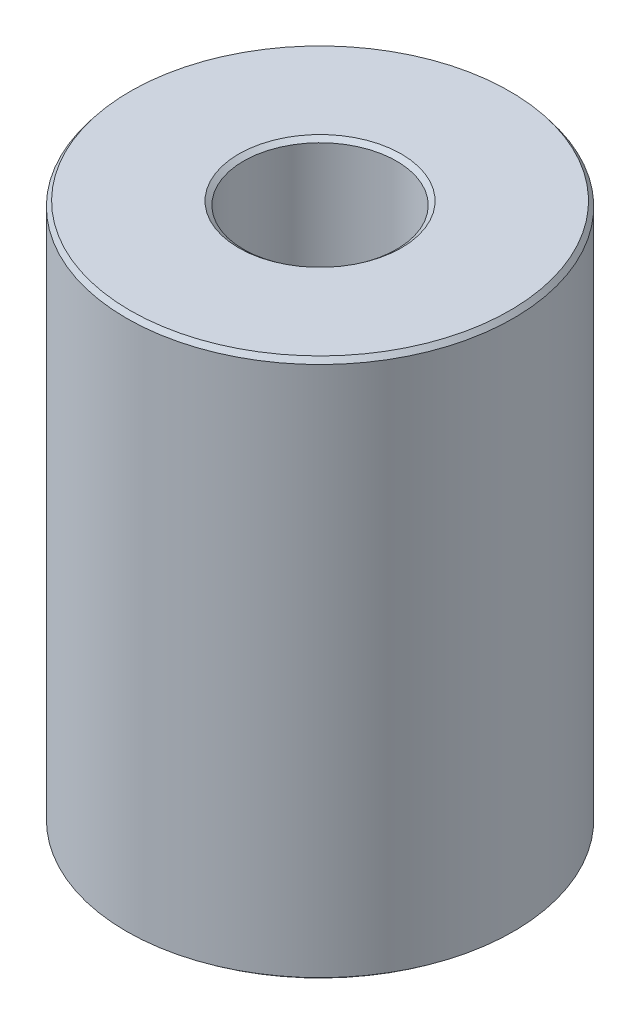
ISO-10303-21;
HEADER;
FILE_DESCRIPTION(('STEP AP214'),'2;1');
FILE_NAME('part.step','',(''),(''),'','','');
FILE_SCHEMA(('AUTOMOTIVE_DESIGN { 1 0 10303 214 1 1 1 1 }'));
ENDSEC;
DATA;
#1=APPLICATION_CONTEXT('core data for automotive mechanical design processes');
#2=APPLICATION_PROTOCOL_DEFINITION('international standard','automotive_design',2000,#1);
#3=PRODUCT_CONTEXT('',#1,'mechanical');
#4=PRODUCT('Part','Part','',(#3));
#5=PRODUCT_RELATED_PRODUCT_CATEGORY('part','',(#4));
#6=PRODUCT_DEFINITION_FORMATION('','',#4);
#7=PRODUCT_DEFINITION_CONTEXT('part definition',#1,'design');
#8=PRODUCT_DEFINITION('design','',#6,#7);
#9=PRODUCT_DEFINITION_SHAPE('','',#8);
#10=(LENGTH_UNIT() NAMED_UNIT(*) SI_UNIT(.MILLI.,.METRE.));
#11=(NAMED_UNIT(*) PLANE_ANGLE_UNIT() SI_UNIT($,.RADIAN.));
#12=(NAMED_UNIT(*) SI_UNIT($,.STERADIAN.) SOLID_ANGLE_UNIT());
#13=UNCERTAINTY_MEASURE_WITH_UNIT(LENGTH_MEASURE(1.E-05),#10,'distance_accuracy_value','');
#14=(GEOMETRIC_REPRESENTATION_CONTEXT(3) GLOBAL_UNCERTAINTY_ASSIGNED_CONTEXT((#13)) GLOBAL_UNIT_ASSIGNED_CONTEXT((#10,
#11,#12)) REPRESENTATION_CONTEXT('',''));
#15=CARTESIAN_POINT('',(0.,0.,0.));
#16=DIRECTION('',(0.,0.,1.));
#17=DIRECTION('',(1.,0.,0.));
#18=AXIS2_PLACEMENT_3D('',#15,#16,#17);
#19=CARTESIAN_POINT('',(0.,132.421435389082,0.));
#20=DIRECTION('',(0.,-1.,0.));
#21=DIRECTION('',(0.,0.,-1.));
#22=AXIS2_PLACEMENT_3D('',#19,#20,#21);
#23=CYLINDRICAL_SURFACE('',#22,47.5);
#24=CARTESIAN_POINT('',(0.,0.906216101475843,0.));
#25=DIRECTION('',(0.,1.,0.));
#26=DIRECTION('',(0.,0.,1.));
#27=AXIS2_PLACEMENT_3D('',#24,#25,#26);
#28=CIRCLE('',#27,47.5);
#29=CARTESIAN_POINT('',(0.,0.906216101475843,47.5));
#30=VERTEX_POINT('',#29);
#31=EDGE_CURVE('E10',#30,#30,#28,.T.);
#32=ORIENTED_EDGE('',*,*,#31,.T.);
#33=EDGE_LOOP('',(#32));
#34=FACE_BOUND('',#33,.T.);
#35=CARTESIAN_POINT('',(0.,131.234687989428,0.));
#36=DIRECTION('',(0.,1.,0.));
#37=DIRECTION('',(0.,0.,1.));
#38=AXIS2_PLACEMENT_3D('',#35,#36,#37);
#39=CIRCLE('',#38,47.5);
#40=CARTESIAN_POINT('',(0.,131.234687989428,47.5));
#41=VERTEX_POINT('',#40);
#42=EDGE_CURVE('E50',#41,#41,#39,.F.);
#43=ORIENTED_EDGE('',*,*,#42,.T.);
#44=EDGE_LOOP('',(#43));
#45=FACE_BOUND('',#44,.T.);
#46=ADVANCED_FACE('F39',(#34,#45),#23,.T.);
#47=CARTESIAN_POINT('',(0.,132.421435389082,0.));
#48=DIRECTION('',(0.,1.,0.));
#49=DIRECTION('',(0.,0.,1.));
#50=AXIS2_PLACEMENT_3D('',#47,#48,#49);
#51=PLANE('',#50);
#52=CARTESIAN_POINT('',(0.,132.421435389082,0.));
#53=DIRECTION('',(0.,1.,0.));
#54=DIRECTION('',(0.,0.,1.));
#55=AXIS2_PLACEMENT_3D('',#52,#53,#54);
#56=CIRCLE('',#55,19.9673049702726);
#57=CARTESIAN_POINT('',(0.,132.421435389082,19.9673049702726));
#58=VERTEX_POINT('',#57);
#59=EDGE_CURVE('E58',#58,#58,#56,.F.);
#60=ORIENTED_EDGE('',*,*,#59,.T.);
#61=EDGE_LOOP('',(#60));
#62=FACE_BOUND('',#61,.T.);
#63=CARTESIAN_POINT('',(0.,132.421435389082,0.));
#64=DIRECTION('',(0.,1.,0.));
#65=DIRECTION('',(0.,0.,1.));
#66=AXIS2_PLACEMENT_3D('',#63,#64,#65);
#67=CIRCLE('',#66,46.5937838985241);
#68=CARTESIAN_POINT('',(0.,132.421435389082,46.5937838985241));
#69=VERTEX_POINT('',#68);
#70=EDGE_CURVE('E61',#69,#69,#67,.T.);
#71=ORIENTED_EDGE('',*,*,#70,.T.);
#72=EDGE_LOOP('',(#71));
#73=FACE_BOUND('',#72,.T.);
#74=ADVANCED_FACE('F88',(#62,#73),#51,.T.);
#75=CARTESIAN_POINT('',(0.,0.,0.));
#76=DIRECTION('',(0.,1.,0.));
#77=DIRECTION('',(0.,0.,1.));
#78=AXIS2_PLACEMENT_3D('',#75,#76,#77);
#79=PLANE('',#78);
#80=CARTESIAN_POINT('',(0.,0.,0.));
#81=DIRECTION('',(0.,1.,0.));
#82=DIRECTION('',(0.,0.,1.));
#83=AXIS2_PLACEMENT_3D('',#80,#81,#82);
#84=CIRCLE('',#83,19.6867736720945);
#85=CARTESIAN_POINT('',(0.,0.,19.6867736720945));
#86=VERTEX_POINT('',#85);
#87=EDGE_CURVE('E51',#86,#86,#84,.T.);
#88=ORIENTED_EDGE('',*,*,#87,.T.);
#89=EDGE_LOOP('',(#88));
#90=FACE_BOUND('',#89,.T.);
#91=CARTESIAN_POINT('',(0.,0.,0.));
#92=DIRECTION('',(0.,1.,0.));
#93=DIRECTION('',(0.,0.,1.));
#94=AXIS2_PLACEMENT_3D('',#91,#92,#93);
#95=CIRCLE('',#94,46.3132526003461);
#96=CARTESIAN_POINT('',(0.,0.,46.3132526003461));
#97=VERTEX_POINT('',#96);
#98=EDGE_CURVE('E54',#97,#97,#95,.F.);
#99=ORIENTED_EDGE('',*,*,#98,.T.);
#100=EDGE_LOOP('',(#99));
#101=FACE_BOUND('',#100,.T.);
#102=ADVANCED_FACE('F83',(#90,#101),#79,.F.);
#103=CARTESIAN_POINT('',(0.,132.421435389082,0.));
#104=DIRECTION('',(0.,-1.,0.));
#105=DIRECTION('',(0.,0.,-1.));
#106=AXIS2_PLACEMENT_3D('',#103,#104,#105);
#107=CYLINDRICAL_SURFACE('',#106,18.7805575706187);
#108=CARTESIAN_POINT('',(0.,131.515219287606,0.));
#109=DIRECTION('',(0.,1.,0.));
#110=DIRECTION('',(0.,0.,1.));
#111=AXIS2_PLACEMENT_3D('',#108,#109,#110);
#112=CIRCLE('',#111,18.7805575706187);
#113=CARTESIAN_POINT('',(0.,131.515219287606,18.7805575706187));
#114=VERTEX_POINT('',#113);
#115=EDGE_CURVE('E67',#114,#114,#112,.T.);
#116=ORIENTED_EDGE('',*,*,#115,.T.);
#117=EDGE_LOOP('',(#116));
#118=FACE_BOUND('',#117,.T.);
#119=CARTESIAN_POINT('',(0.,1.18674739965385,0.));
#120=DIRECTION('',(0.,1.,0.));
#121=DIRECTION('',(0.,0.,1.));
#122=AXIS2_PLACEMENT_3D('',#119,#120,#121);
#123=CIRCLE('',#122,18.7805575706187);
#124=CARTESIAN_POINT('',(0.,1.18674739965385,18.7805575706187));
#125=VERTEX_POINT('',#124);
#126=EDGE_CURVE('E69',#125,#125,#123,.F.);
#127=ORIENTED_EDGE('',*,*,#126,.T.);
#128=EDGE_LOOP('',(#127));
#129=FACE_BOUND('',#128,.T.);
#130=ADVANCED_FACE('F71',(#118,#129),#107,.F.);
#131=CARTESIAN_POINT('',(0.,131.515219287606,0.));
#132=DIRECTION('',(0.,1.,0.));
#133=DIRECTION('',(0.,0.,1.));
#134=AXIS2_PLACEMENT_3D('',#131,#132,#133);
#135=CONICAL_SURFACE('',#134,18.7805575706187,0.918639481693091);
#136=CARTESIAN_POINT('',(0.,132.421435389082,19.9673049702726));
#137=CARTESIAN_POINT('',(0.,132.411995638025,19.9549430181928));
#138=CARTESIAN_POINT('',(0.,132.402555886968,19.9425810661131));
#139=CARTESIAN_POINT('',(0.,132.383676384854,19.9178571619536));
#140=CARTESIAN_POINT('',(0.,132.374236633797,19.9054952098739));
#141=CARTESIAN_POINT('',(0.,132.355357131683,19.8807713057145));
#142=CARTESIAN_POINT('',(0.,132.345917380626,19.8684093536347));
#143=CARTESIAN_POINT('',(0.,132.327037878512,19.8436854494753));
#144=CARTESIAN_POINT('',(0.,132.317598127455,19.8313234973955));
#145=CARTESIAN_POINT('',(0.,132.298718625341,19.8065995932361));
#146=CARTESIAN_POINT('',(0.,132.289278874283,19.7942376411564));
#147=CARTESIAN_POINT('',(0.,132.270399372169,19.7695137369969));
#148=CARTESIAN_POINT('',(0.,132.260959621112,19.7571517849172));
#149=CARTESIAN_POINT('',(0.,132.242080118998,19.7324278807577));
#150=CARTESIAN_POINT('',(0.,132.232640367941,19.720065928678));
#151=CARTESIAN_POINT('',(0.,132.213760865827,19.6953420245185));
#152=CARTESIAN_POINT('',(0.,132.20432111477,19.6829800724388));
#153=CARTESIAN_POINT('',(0.,132.185441612656,19.6582561682794));
#154=CARTESIAN_POINT('',(0.,132.176001861599,19.6458942161996));
#155=CARTESIAN_POINT('',(0.,132.157122359485,19.6211703120402));
#156=CARTESIAN_POINT('',(0.,132.147682608428,19.6088083599604));
#157=CARTESIAN_POINT('',(0.,132.128803106314,19.584084455801));
#158=CARTESIAN_POINT('',(0.,132.119363355257,19.5717225037213));
#159=CARTESIAN_POINT('',(0.,132.100483853143,19.5469985995618));
#160=CARTESIAN_POINT('',(0.,132.091044102086,19.5346366474821));
#161=CARTESIAN_POINT('',(0.,132.072164599972,19.5099127433226));
#162=CARTESIAN_POINT('',(0.,132.062724848915,19.4975507912429));
#163=CARTESIAN_POINT('',(0.,132.0438453468,19.4728268870834));
#164=CARTESIAN_POINT('',(0.,132.034405595743,19.4604649350037));
#165=CARTESIAN_POINT('',(0.,132.015526093629,19.4357410308442));
#166=CARTESIAN_POINT('',(0.,132.006086342572,19.4233790787645));
#167=CARTESIAN_POINT('',(0.,131.987206840458,19.3986551746051));
#168=CARTESIAN_POINT('',(0.,131.977767089401,19.3862932225253));
#169=CARTESIAN_POINT('',(0.,131.958887587287,19.3615693183659));
#170=CARTESIAN_POINT('',(0.,131.94944783623,19.3492073662861));
#171=CARTESIAN_POINT('',(0.,131.930568334116,19.3244834621267));
#172=CARTESIAN_POINT('',(0.,131.921128583059,19.312121510047));
#173=CARTESIAN_POINT('',(0.,131.902249080945,19.2873976058875));
#174=CARTESIAN_POINT('',(0.,131.892809329888,19.2750356538078));
#175=CARTESIAN_POINT('',(0.,131.873929827774,19.2503117496483));
#176=CARTESIAN_POINT('',(0.,131.864490076717,19.2379497975686));
#177=CARTESIAN_POINT('',(0.,131.845610574603,19.2132258934091));
#178=CARTESIAN_POINT('',(0.,131.836170823546,19.2008639413294));
#179=CARTESIAN_POINT('',(0.,131.817291321431,19.17614003717));
#180=CARTESIAN_POINT('',(0.,131.807851570374,19.1637780850902));
#181=CARTESIAN_POINT('',(0.,131.78897206826,19.1390541809308));
#182=CARTESIAN_POINT('',(0.,131.779532317203,19.126692228851));
#183=CARTESIAN_POINT('',(0.,131.760652815089,19.1019683246916));
#184=CARTESIAN_POINT('',(0.,131.751213064032,19.0896063726119));
#185=CARTESIAN_POINT('',(0.,131.732333561918,19.0648824684524));
#186=CARTESIAN_POINT('',(0.,131.722893810861,19.0525205163727));
#187=CARTESIAN_POINT('',(0.,131.704014308747,19.0277966122132));
#188=CARTESIAN_POINT('',(0.,131.69457455769,19.0154346601335));
#189=CARTESIAN_POINT('',(0.,131.675695055576,18.990710755974));
#190=CARTESIAN_POINT('',(0.,131.666255304519,18.9783488038943));
#191=CARTESIAN_POINT('',(0.,131.647375802405,18.9536248997348));
#192=CARTESIAN_POINT('',(0.,131.637936051348,18.9412629476551));
#193=CARTESIAN_POINT('',(0.,131.619056549234,18.9165390434957));
#194=CARTESIAN_POINT('',(0.,131.609616798177,18.9041770914159));
#195=CARTESIAN_POINT('',(0.,131.590737296062,18.8794531872565));
#196=CARTESIAN_POINT('',(0.,131.581297545005,18.8670912351767));
#197=CARTESIAN_POINT('',(0.,131.562418042891,18.8423673310173));
#198=CARTESIAN_POINT('',(0.,131.552978291834,18.8300053789376));
#199=CARTESIAN_POINT('',(0.,131.53409878972,18.8052814747781));
#200=CARTESIAN_POINT('',(0.,131.524659038663,18.7929195226984));
#201=CARTESIAN_POINT('',(0.,131.515219287606,18.7805575706187));
#202=B_SPLINE_CURVE_WITH_KNOTS('',3,(#136,#137,#138,#139,#140,#141,#142,#143,#144,#145,#146,
#147,#148,#149,#150,#151,#152,#153,#154,#155,#156,#157,#158,#159,#160,#161,#162,#163,#164,#165,
#166,#167,#168,#169,#170,#171,#172,#173,#174,#175,#176,#177,#178,#179,#180,#181,#182,#183,#184,
#185,#186,#187,#188,#189,#190,#191,#192,#193,#194,#195,#196,#197,#198,#199,#200,#201),
.UNSPECIFIED.,.F.,.F.,(4,2,2,2,2,2,2,2,2,2,2,2,2,2,2,2,2,2,2,2,2,2,2,2,2,2,2,2,2,2,2,2,4),(0.,
0.0466619848823825,0.0933239697647623,0.139985954647145,0.186647939529525,0.233309924411907,
0.279971909294287,0.326633894176667,0.373295879059049,0.419957863941429,0.466619848823811,
0.513281833706191,0.559943818588573,0.606605803470953,0.653267788353336,0.699929773235716,
0.746591758118098,0.793253743000478,0.83991572788286,0.88657771276524,0.933239697647623,
0.979901682530002,1.02656366741239,1.07322565229476,1.11988763717714,1.16654962205953,
1.21321160694191,1.25987359182429,1.30653557670667,1.35319756158905,1.39985954647143,
1.44652153135381,1.49318351623618),.UNSPECIFIED.);
#203=EDGE_CURVE('BSEAM77',#58,#114,#202,.T.);
#204=ORIENTED_EDGE('',*,*,#59,.F.);
#205=ORIENTED_EDGE('',*,*,#115,.F.);
#206=ORIENTED_EDGE('',*,*,#203,.T.);
#207=ORIENTED_EDGE('',*,*,#203,.F.);
#208=EDGE_LOOP('',(#204,#206,#205,#207));
#209=FACE_BOUND('',#208,.T.);
#210=ADVANCED_FACE('F77',(#209),#135,.F.);
#211=CARTESIAN_POINT('',(0.,0.,0.));
#212=DIRECTION('',(0.,-1.,0.));
#213=DIRECTION('',(0.,0.,-1.));
#214=AXIS2_PLACEMENT_3D('',#211,#212,#213);
#215=CONICAL_SURFACE('',#214,19.6867736720945,0.65215684510181);
#216=ORIENTED_EDGE('',*,*,#126,.F.);
#217=EDGE_LOOP('',(#216));
#218=FACE_BOUND('',#217,.T.);
#219=ORIENTED_EDGE('',*,*,#87,.F.);
#220=EDGE_LOOP('',(#219));
#221=FACE_BOUND('',#220,.T.);
#222=ADVANCED_FACE('F73',(#218,#221),#215,.F.);
#223=CARTESIAN_POINT('',(0.,0.906216101475843,0.));
#224=DIRECTION('',(0.,1.,0.));
#225=DIRECTION('',(0.,0.,1.));
#226=AXIS2_PLACEMENT_3D('',#223,#224,#225);
#227=CONICAL_SURFACE('',#226,47.5,0.918639481693094);
#228=ORIENTED_EDGE('',*,*,#98,.F.);
#229=EDGE_LOOP('',(#228));
#230=FACE_BOUND('',#229,.T.);
#231=ORIENTED_EDGE('',*,*,#31,.F.);
#232=EDGE_LOOP('',(#231));
#233=FACE_BOUND('',#232,.T.);
#234=ADVANCED_FACE('F76',(#230,#233),#227,.T.);
#235=CARTESIAN_POINT('',(0.,132.421435389082,0.));
#236=DIRECTION('',(0.,-1.,0.));
#237=DIRECTION('',(0.,0.,-1.));
#238=AXIS2_PLACEMENT_3D('',#235,#236,#237);
#239=CONICAL_SURFACE('',#238,46.5937838985241,0.652156845101808);
#240=ORIENTED_EDGE('',*,*,#42,.F.);
#241=EDGE_LOOP('',(#240));
#242=FACE_BOUND('',#241,.T.);
#243=ORIENTED_EDGE('',*,*,#70,.F.);
#244=EDGE_LOOP('',(#243));
#245=FACE_BOUND('',#244,.T.);
#246=ADVANCED_FACE('F45',(#242,#245),#239,.T.);
#247=CLOSED_SHELL('',(#46,#74,#102,#130,#210,#222,#234,#246));
#248=MANIFOLD_SOLID_BREP('B2',#247);
#249=ADVANCED_BREP_SHAPE_REPRESENTATION('',(#18,#248),#14);
#250=SHAPE_DEFINITION_REPRESENTATION(#9,#249);
ENDSEC;
END-ISO-10303-21;
